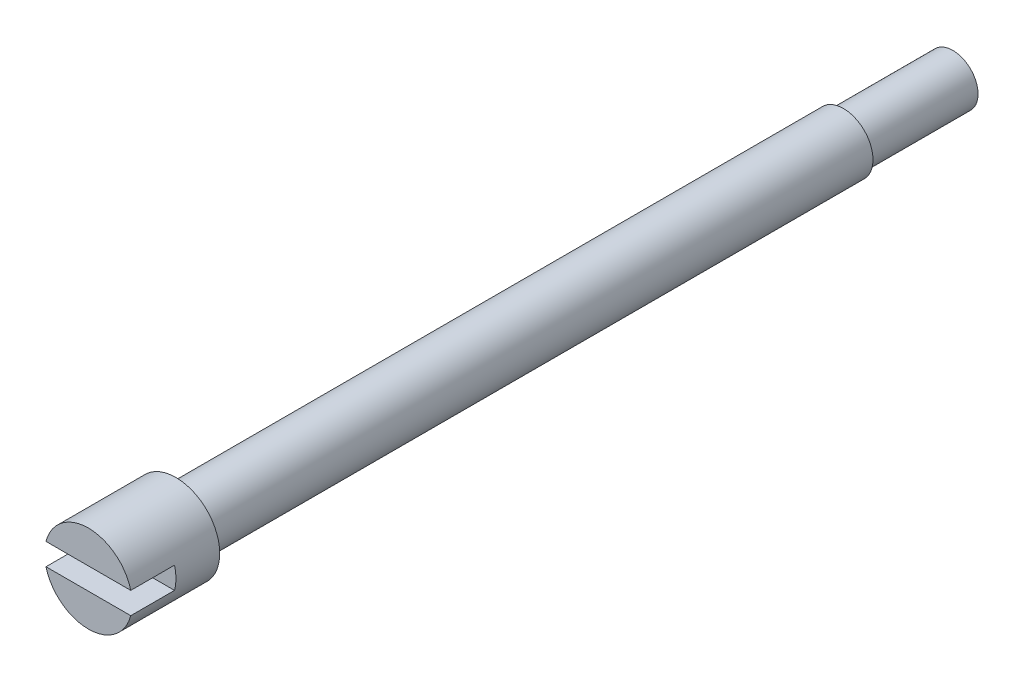
ISO-10303-21;
HEADER;
FILE_DESCRIPTION(('STEP AP214'),'2;1');
FILE_NAME('part.step','',(''),(''),'','','');
FILE_SCHEMA(('AUTOMOTIVE_DESIGN { 1 0 10303 214 1 1 1 1 }'));
ENDSEC;
DATA;
#1=APPLICATION_CONTEXT('core data for automotive mechanical design processes');
#2=APPLICATION_PROTOCOL_DEFINITION('international standard','automotive_design',2000,#1);
#3=PRODUCT_CONTEXT('',#1,'mechanical');
#4=PRODUCT('Part','Part','',(#3));
#5=PRODUCT_RELATED_PRODUCT_CATEGORY('part','',(#4));
#6=PRODUCT_DEFINITION_FORMATION('','',#4);
#7=PRODUCT_DEFINITION_CONTEXT('part definition',#1,'design');
#8=PRODUCT_DEFINITION('design','',#6,#7);
#9=PRODUCT_DEFINITION_SHAPE('','',#8);
#10=(LENGTH_UNIT() NAMED_UNIT(*) SI_UNIT(.MILLI.,.METRE.));
#11=(NAMED_UNIT(*) PLANE_ANGLE_UNIT() SI_UNIT($,.RADIAN.));
#12=(NAMED_UNIT(*) SI_UNIT($,.STERADIAN.) SOLID_ANGLE_UNIT());
#13=UNCERTAINTY_MEASURE_WITH_UNIT(LENGTH_MEASURE(1.E-05),#10,'distance_accuracy_value','');
#14=(GEOMETRIC_REPRESENTATION_CONTEXT(3) GLOBAL_UNCERTAINTY_ASSIGNED_CONTEXT((#13)) GLOBAL_UNIT_ASSIGNED_CONTEXT((#10,
#11,#12)) REPRESENTATION_CONTEXT('',''));
#15=CARTESIAN_POINT('',(0.,0.,0.));
#16=DIRECTION('',(0.,0.,1.));
#17=DIRECTION('',(1.,0.,0.));
#18=AXIS2_PLACEMENT_3D('',#15,#16,#17);
#19=CARTESIAN_POINT('',(0.,0.,35.5));
#20=DIRECTION('',(0.,0.,-1.));
#21=DIRECTION('',(-1.,0.,0.));
#22=AXIS2_PLACEMENT_3D('',#19,#20,#21);
#23=CYLINDRICAL_SURFACE('',#22,1.35);
#24=CARTESIAN_POINT('',(0.,0.,35.5));
#25=DIRECTION('',(0.,0.,1.));
#26=DIRECTION('',(1.,0.,0.));
#27=AXIS2_PLACEMENT_3D('',#24,#25,#26);
#28=CIRCLE('',#27,1.35);
#29=CARTESIAN_POINT('',(1.35,0.,35.5));
#30=VERTEX_POINT('',#29);
#31=EDGE_CURVE('E81',#30,#30,#28,.T.);
#32=ORIENTED_EDGE('',*,*,#31,.F.);
#33=EDGE_LOOP('',(#32));
#34=FACE_BOUND('',#33,.T.);
#35=CARTESIAN_POINT('',(0.,0.,5.));
#36=DIRECTION('',(0.,0.,-1.));
#37=DIRECTION('',(-1.,0.,0.));
#38=AXIS2_PLACEMENT_3D('',#35,#36,#37);
#39=CIRCLE('',#38,1.35);
#40=CARTESIAN_POINT('',(-1.35,0.,5.));
#41=VERTEX_POINT('',#40);
#42=EDGE_CURVE('E38',#41,#41,#39,.T.);
#43=ORIENTED_EDGE('',*,*,#42,.F.);
#44=EDGE_LOOP('',(#43));
#45=FACE_BOUND('',#44,.T.);
#46=ADVANCED_FACE('F35',(#34,#45),#23,.T.);
#47=CARTESIAN_POINT('',(0.,0.,39.5));
#48=DIRECTION('',(0.,0.,1.));
#49=DIRECTION('',(1.,0.,0.));
#50=AXIS2_PLACEMENT_3D('',#47,#48,#49);
#51=PLANE('',#50);
#52=DIRECTION('',(-1.,0.,0.));
#53=VECTOR('',#52,1.);
#54=CARTESIAN_POINT('',(0.,0.5,39.5));
#55=LINE('',#54,#53);
#56=CARTESIAN_POINT('',(1.93649167310371,0.5,39.5));
#57=VERTEX_POINT('',#56);
#58=CARTESIAN_POINT('',(-1.93649167310371,0.5,39.5));
#59=VERTEX_POINT('',#58);
#60=EDGE_CURVE('E80',#57,#59,#55,.T.);
#61=ORIENTED_EDGE('',*,*,#60,.F.);
#62=CARTESIAN_POINT('',(0.,0.,39.5));
#63=DIRECTION('',(0.,0.,1.));
#64=DIRECTION('',(1.,0.,0.));
#65=AXIS2_PLACEMENT_3D('',#62,#63,#64);
#66=CIRCLE('',#65,2.);
#67=EDGE_CURVE('E91',#57,#59,#66,.T.);
#68=ORIENTED_EDGE('',*,*,#67,.T.);
#69=EDGE_LOOP('',(#61,#68));
#70=FACE_BOUND('',#69,.T.);
#71=ADVANCED_FACE('F130',(#70),#51,.T.);
#72=CARTESIAN_POINT('',(0.,0.,35.5));
#73=DIRECTION('',(0.,0.,1.));
#74=DIRECTION('',(1.,0.,0.));
#75=AXIS2_PLACEMENT_3D('',#72,#73,#74);
#76=PLANE('',#75);
#77=CARTESIAN_POINT('',(0.,0.,35.5));
#78=DIRECTION('',(0.,0.,1.));
#79=DIRECTION('',(1.,0.,0.));
#80=AXIS2_PLACEMENT_3D('',#77,#78,#79);
#81=CIRCLE('',#80,2.);
#82=CARTESIAN_POINT('',(2.,0.,35.5));
#83=VERTEX_POINT('',#82);
#84=EDGE_CURVE('E92',#83,#83,#81,.T.);
#85=ORIENTED_EDGE('',*,*,#84,.F.);
#86=EDGE_LOOP('',(#85));
#87=FACE_BOUND('',#86,.T.);
#88=ORIENTED_EDGE('',*,*,#31,.T.);
#89=EDGE_LOOP('',(#88));
#90=FACE_BOUND('',#89,.T.);
#91=ADVANCED_FACE('F137',(#87,#90),#76,.F.);
#92=CARTESIAN_POINT('',(0.,0.,39.5));
#93=DIRECTION('',(0.,0.,-1.));
#94=DIRECTION('',(-1.,0.,0.));
#95=AXIS2_PLACEMENT_3D('',#92,#93,#94);
#96=CYLINDRICAL_SURFACE('',#95,2.);
#97=CARTESIAN_POINT('',(0.,0.,37.5));
#98=DIRECTION('',(0.,0.,1.));
#99=DIRECTION('',(1.,0.,0.));
#100=AXIS2_PLACEMENT_3D('',#97,#98,#99);
#101=CIRCLE('',#100,2.);
#102=CARTESIAN_POINT('',(-1.93649167310371,0.5,37.5));
#103=VERTEX_POINT('',#102);
#104=CARTESIAN_POINT('',(-1.93649167310371,-0.5,37.5));
#105=VERTEX_POINT('',#104);
#106=EDGE_CURVE('E12',#103,#105,#101,.T.);
#107=ORIENTED_EDGE('',*,*,#106,.F.);
#108=DIRECTION('',(0.,0.,-1.));
#109=VECTOR('',#108,1.);
#110=CARTESIAN_POINT('',(-1.93649167310371,0.5,39.5));
#111=LINE('',#110,#109);
#112=EDGE_CURVE('E111',#103,#59,#111,.F.);
#113=ORIENTED_EDGE('',*,*,#112,.T.);
#114=ORIENTED_EDGE('',*,*,#67,.F.);
#115=DIRECTION('',(0.,0.,-1.));
#116=VECTOR('',#115,1.);
#117=CARTESIAN_POINT('',(1.93649167310371,0.5,39.5));
#118=LINE('',#117,#116);
#119=CARTESIAN_POINT('',(1.93649167310371,0.5,37.5));
#120=VERTEX_POINT('',#119);
#121=EDGE_CURVE('E96',#57,#120,#118,.T.);
#122=ORIENTED_EDGE('',*,*,#121,.T.);
#123=CARTESIAN_POINT('',(1.93649167310371,-0.5,37.5));
#124=VERTEX_POINT('',#123);
#125=EDGE_CURVE('E43',#124,#120,#101,.T.);
#126=ORIENTED_EDGE('',*,*,#125,.F.);
#127=DIRECTION('',(0.,0.,-1.));
#128=VECTOR('',#127,1.);
#129=CARTESIAN_POINT('',(1.93649167310371,-0.5,39.5));
#130=LINE('',#129,#128);
#131=CARTESIAN_POINT('',(1.93649167310371,-0.5,39.5));
#132=VERTEX_POINT('',#131);
#133=EDGE_CURVE('E75',#124,#132,#130,.F.);
#134=ORIENTED_EDGE('',*,*,#133,.T.);
#135=CARTESIAN_POINT('',(-1.93649167310371,-0.5,39.5));
#136=VERTEX_POINT('',#135);
#137=EDGE_CURVE('E86',#136,#132,#66,.T.);
#138=ORIENTED_EDGE('',*,*,#137,.F.);
#139=DIRECTION('',(0.,0.,-1.));
#140=VECTOR('',#139,1.);
#141=CARTESIAN_POINT('',(-1.93649167310371,-0.5,39.5));
#142=LINE('',#141,#140);
#143=EDGE_CURVE('E50',#136,#105,#142,.T.);
#144=ORIENTED_EDGE('',*,*,#143,.T.);
#145=EDGE_LOOP('',(#107,#113,#114,#122,#126,#134,#138,#144));
#146=FACE_BOUND('',#145,.T.);
#147=ORIENTED_EDGE('',*,*,#84,.T.);
#148=EDGE_LOOP('',(#147));
#149=FACE_BOUND('',#148,.T.);
#150=ADVANCED_FACE('F84',(#146,#149),#96,.T.);
#151=DIRECTION('',(1.,0.,0.));
#152=VECTOR('',#151,1.);
#153=CARTESIAN_POINT('',(0.,-0.5,39.5));
#154=LINE('',#153,#152);
#155=EDGE_CURVE('E72',#136,#132,#154,.T.);
#156=ORIENTED_EDGE('',*,*,#155,.F.);
#157=ORIENTED_EDGE('',*,*,#137,.T.);
#158=EDGE_LOOP('',(#156,#157));
#159=FACE_BOUND('',#158,.T.);
#160=ADVANCED_FACE('F90',(#159),#51,.T.);
#161=CARTESIAN_POINT('',(0.,0.,37.5));
#162=DIRECTION('',(0.,0.,1.));
#163=DIRECTION('',(1.,0.,0.));
#164=AXIS2_PLACEMENT_3D('',#161,#162,#163);
#165=PLANE('',#164);
#166=DIRECTION('',(-1.,0.,0.));
#167=VECTOR('',#166,1.);
#168=CARTESIAN_POINT('',(2.,0.5,37.5));
#169=LINE('',#168,#167);
#170=EDGE_CURVE('E88',#120,#103,#169,.T.);
#171=ORIENTED_EDGE('',*,*,#170,.T.);
#172=ORIENTED_EDGE('',*,*,#106,.T.);
#173=DIRECTION('',(1.,0.,0.));
#174=VECTOR('',#173,1.);
#175=CARTESIAN_POINT('',(2.,-0.5,37.5));
#176=LINE('',#175,#174);
#177=EDGE_CURVE('E107',#105,#124,#176,.T.);
#178=ORIENTED_EDGE('',*,*,#177,.T.);
#179=ORIENTED_EDGE('',*,*,#125,.T.);
#180=EDGE_LOOP('',(#171,#172,#178,#179));
#181=FACE_BOUND('',#180,.T.);
#182=ADVANCED_FACE('F106',(#181),#165,.T.);
#183=CARTESIAN_POINT('',(2.,0.5,37.5));
#184=DIRECTION('',(0.,1.,0.));
#185=DIRECTION('',(0.,0.,1.));
#186=AXIS2_PLACEMENT_3D('',#183,#184,#185);
#187=PLANE('',#186);
#188=ORIENTED_EDGE('',*,*,#60,.T.);
#189=ORIENTED_EDGE('',*,*,#112,.F.);
#190=ORIENTED_EDGE('',*,*,#170,.F.);
#191=ORIENTED_EDGE('',*,*,#121,.F.);
#192=EDGE_LOOP('',(#188,#189,#190,#191));
#193=FACE_BOUND('',#192,.T.);
#194=ADVANCED_FACE('F109',(#193),#187,.F.);
#195=CARTESIAN_POINT('',(2.,-0.5,37.5));
#196=DIRECTION('',(0.,-1.,0.));
#197=DIRECTION('',(0.,0.,-1.));
#198=AXIS2_PLACEMENT_3D('',#195,#196,#197);
#199=PLANE('',#198);
#200=ORIENTED_EDGE('',*,*,#155,.T.);
#201=ORIENTED_EDGE('',*,*,#133,.F.);
#202=ORIENTED_EDGE('',*,*,#177,.F.);
#203=ORIENTED_EDGE('',*,*,#143,.F.);
#204=EDGE_LOOP('',(#200,#201,#202,#203));
#205=FACE_BOUND('',#204,.T.);
#206=ADVANCED_FACE('F74',(#205),#199,.F.);
#207=CARTESIAN_POINT('',(0.,0.,5.));
#208=DIRECTION('',(0.,0.,-1.));
#209=DIRECTION('',(-1.,0.,0.));
#210=AXIS2_PLACEMENT_3D('',#207,#208,#209);
#211=PLANE('',#210);
#212=CARTESIAN_POINT('',(0.,0.,5.));
#213=DIRECTION('',(0.,0.,-1.));
#214=DIRECTION('',(-1.,0.,0.));
#215=AXIS2_PLACEMENT_3D('',#212,#213,#214);
#216=CIRCLE('',#215,1.15);
#217=CARTESIAN_POINT('',(-1.15,0.,5.));
#218=VERTEX_POINT('',#217);
#219=EDGE_CURVE('E120',#218,#218,#216,.T.);
#220=ORIENTED_EDGE('',*,*,#219,.F.);
#221=EDGE_LOOP('',(#220));
#222=FACE_BOUND('',#221,.T.);
#223=ORIENTED_EDGE('',*,*,#42,.T.);
#224=EDGE_LOOP('',(#223));
#225=FACE_BOUND('',#224,.T.);
#226=ADVANCED_FACE('F127',(#222,#225),#211,.T.);
#227=CARTESIAN_POINT('',(0.,0.,5.));
#228=DIRECTION('',(0.,0.,-1.));
#229=DIRECTION('',(-1.,0.,0.));
#230=AXIS2_PLACEMENT_3D('',#227,#228,#229);
#231=CYLINDRICAL_SURFACE('',#230,1.15);
#232=ORIENTED_EDGE('',*,*,#219,.T.);
#233=EDGE_LOOP('',(#232));
#234=FACE_BOUND('',#233,.T.);
#235=CARTESIAN_POINT('',(0.,0.,0.));
#236=DIRECTION('',(0.,0.,-1.));
#237=DIRECTION('',(-1.,0.,0.));
#238=AXIS2_PLACEMENT_3D('',#235,#236,#237);
#239=CIRCLE('',#238,1.15);
#240=CARTESIAN_POINT('',(-1.15,0.,0.));
#241=VERTEX_POINT('',#240);
#242=EDGE_CURVE('E117',#241,#241,#239,.T.);
#243=ORIENTED_EDGE('',*,*,#242,.F.);
#244=EDGE_LOOP('',(#243));
#245=FACE_BOUND('',#244,.T.);
#246=ADVANCED_FACE('F153',(#234,#245),#231,.T.);
#247=CARTESIAN_POINT('',(0.,0.,0.));
#248=DIRECTION('',(0.,0.,1.));
#249=DIRECTION('',(1.,0.,0.));
#250=AXIS2_PLACEMENT_3D('',#247,#248,#249);
#251=PLANE('',#250);
#252=ORIENTED_EDGE('',*,*,#242,.T.);
#253=EDGE_LOOP('',(#252));
#254=FACE_BOUND('',#253,.T.);
#255=ADVANCED_FACE('F151',(#254),#251,.F.);
#256=CLOSED_SHELL('',(#46,#71,#91,#150,#160,#182,#194,#206,#226,#246,#255));
#257=MANIFOLD_SOLID_BREP('B2',#256);
#258=ADVANCED_BREP_SHAPE_REPRESENTATION('',(#18,#257),#14);
#259=SHAPE_DEFINITION_REPRESENTATION(#9,#258);
ENDSEC;
END-ISO-10303-21;
